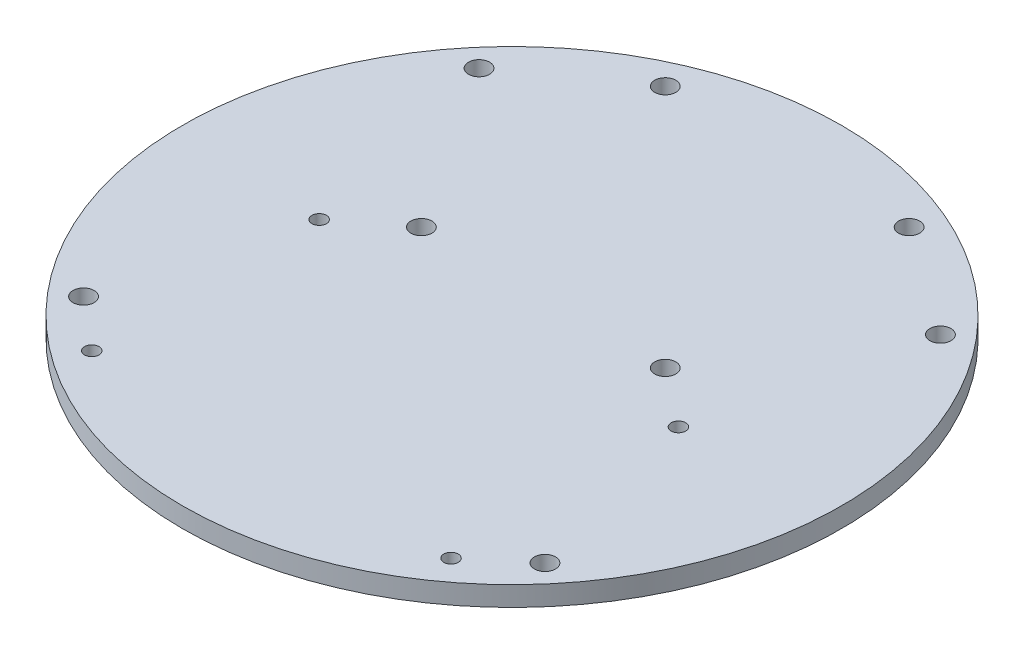
ISO-10303-21;
HEADER;
FILE_DESCRIPTION(('STEP AP214'),'2;1');
FILE_NAME('part.step','',(''),(''),'','','');
FILE_SCHEMA(('AUTOMOTIVE_DESIGN { 1 0 10303 214 1 1 1 1 }'));
ENDSEC;
DATA;
#1=APPLICATION_CONTEXT('core data for automotive mechanical design processes');
#2=APPLICATION_PROTOCOL_DEFINITION('international standard','automotive_design',2000,#1);
#3=PRODUCT_CONTEXT('',#1,'mechanical');
#4=PRODUCT('Part','Part','',(#3));
#5=PRODUCT_RELATED_PRODUCT_CATEGORY('part','',(#4));
#6=PRODUCT_DEFINITION_FORMATION('','',#4);
#7=PRODUCT_DEFINITION_CONTEXT('part definition',#1,'design');
#8=PRODUCT_DEFINITION('design','',#6,#7);
#9=PRODUCT_DEFINITION_SHAPE('','',#8);
#10=(LENGTH_UNIT() NAMED_UNIT(*) SI_UNIT(.MILLI.,.METRE.));
#11=(NAMED_UNIT(*) PLANE_ANGLE_UNIT() SI_UNIT($,.RADIAN.));
#12=(NAMED_UNIT(*) SI_UNIT($,.STERADIAN.) SOLID_ANGLE_UNIT());
#13=UNCERTAINTY_MEASURE_WITH_UNIT(LENGTH_MEASURE(1.E-05),#10,'distance_accuracy_value','');
#14=(GEOMETRIC_REPRESENTATION_CONTEXT(3) GLOBAL_UNCERTAINTY_ASSIGNED_CONTEXT((#13)) GLOBAL_UNIT_ASSIGNED_CONTEXT((#10,
#11,#12)) REPRESENTATION_CONTEXT('',''));
#15=CARTESIAN_POINT('',(0.,0.,0.));
#16=DIRECTION('',(0.,0.,1.));
#17=DIRECTION('',(1.,0.,0.));
#18=AXIS2_PLACEMENT_3D('',#15,#16,#17);
#19=CARTESIAN_POINT('',(0.,3.,0.));
#20=DIRECTION('',(0.,1.,0.));
#21=DIRECTION('',(0.,0.,1.));
#22=AXIS2_PLACEMENT_3D('',#19,#20,#21);
#23=PLANE('',#22);
#24=CARTESIAN_POINT('',(35.,3.,30.));
#25=DIRECTION('',(0.,1.,0.));
#26=DIRECTION('',(0.,0.,-1.));
#27=AXIS2_PLACEMENT_3D('',#24,#25,#26);
#28=CIRCLE('',#27,1.59999999999999);
#29=CARTESIAN_POINT('',(35.,3.,28.4));
#30=VERTEX_POINT('',#29);
#31=EDGE_CURVE('E128',#30,#30,#28,.T.);
#32=ORIENTED_EDGE('',*,*,#31,.F.);
#33=EDGE_LOOP('',(#32));
#34=FACE_BOUND('',#33,.T.);
#35=CARTESIAN_POINT('',(-35.,3.,30.));
#36=DIRECTION('',(0.,1.,0.));
#37=DIRECTION('',(0.,0.,1.));
#38=AXIS2_PLACEMENT_3D('',#35,#36,#37);
#39=CIRCLE('',#38,1.6);
#40=CARTESIAN_POINT('',(-35.,3.,31.6));
#41=VERTEX_POINT('',#40);
#42=EDGE_CURVE('E112',#41,#41,#39,.T.);
#43=ORIENTED_EDGE('',*,*,#42,.F.);
#44=EDGE_LOOP('',(#43));
#45=FACE_BOUND('',#44,.T.);
#46=CARTESIAN_POINT('',(18.5,3.,-4.75));
#47=DIRECTION('',(0.,1.,0.));
#48=DIRECTION('',(0.,0.,1.));
#49=AXIS2_PLACEMENT_3D('',#46,#47,#48);
#50=CIRCLE('',#49,1.6);
#51=CARTESIAN_POINT('',(18.5,3.,-3.15));
#52=VERTEX_POINT('',#51);
#53=EDGE_CURVE('E96',#52,#52,#50,.T.);
#54=ORIENTED_EDGE('',*,*,#53,.F.);
#55=EDGE_LOOP('',(#54));
#56=FACE_BOUND('',#55,.T.);
#57=CARTESIAN_POINT('',(-18.5,3.,-41.75));
#58=DIRECTION('',(0.,1.,0.));
#59=DIRECTION('',(0.,0.,1.));
#60=AXIS2_PLACEMENT_3D('',#57,#58,#59);
#61=CIRCLE('',#60,1.6);
#62=CARTESIAN_POINT('',(-18.5,3.,-40.15));
#63=VERTEX_POINT('',#62);
#64=EDGE_CURVE('E80',#63,#63,#61,.T.);
#65=ORIENTED_EDGE('',*,*,#64,.F.);
#66=EDGE_LOOP('',(#65));
#67=FACE_BOUND('',#66,.T.);
#68=CARTESIAN_POINT('',(27.25,3.,2.));
#69=DIRECTION('',(0.,1.,0.));
#70=DIRECTION('',(0.,0.,-1.));
#71=AXIS2_PLACEMENT_3D('',#68,#69,#70);
#72=CIRCLE('',#71,1.09999999999999);
#73=CARTESIAN_POINT('',(27.25,3.,0.900000000000015));
#74=VERTEX_POINT('',#73);
#75=EDGE_CURVE('E64',#74,#74,#72,.T.);
#76=ORIENTED_EDGE('',*,*,#75,.F.);
#77=EDGE_LOOP('',(#76));
#78=FACE_BOUND('',#77,.T.);
#79=CARTESIAN_POINT('',(-27.25,3.,2.));
#80=DIRECTION('',(0.,1.,0.));
#81=DIRECTION('',(0.,0.,1.));
#82=AXIS2_PLACEMENT_3D('',#79,#80,#81);
#83=CIRCLE('',#82,1.1);
#84=CARTESIAN_POINT('',(-27.25,3.,3.1));
#85=VERTEX_POINT('',#84);
#86=EDGE_CURVE('E50',#85,#85,#83,.T.);
#87=ORIENTED_EDGE('',*,*,#86,.F.);
#88=EDGE_LOOP('',(#87));
#89=FACE_BOUND('',#88,.T.);
#90=CARTESIAN_POINT('',(0.,3.,0.));
#91=DIRECTION('',(0.,1.,0.));
#92=DIRECTION('',(0.,0.,1.));
#93=AXIS2_PLACEMENT_3D('',#90,#91,#92);
#94=CIRCLE('',#93,50.);
#95=CARTESIAN_POINT('',(0.,3.,50.));
#96=VERTEX_POINT('',#95);
#97=EDGE_CURVE('E10',#96,#96,#94,.T.);
#98=ORIENTED_EDGE('',*,*,#97,.T.);
#99=EDGE_LOOP('',(#98));
#100=FACE_BOUND('',#99,.T.);
#101=CARTESIAN_POINT('',(-27.25,3.,36.5));
#102=DIRECTION('',(0.,1.,0.));
#103=DIRECTION('',(0.,0.,-1.));
#104=AXIS2_PLACEMENT_3D('',#101,#102,#103);
#105=CIRCLE('',#104,1.09999999999999);
#106=CARTESIAN_POINT('',(-27.25,3.,35.4));
#107=VERTEX_POINT('',#106);
#108=EDGE_CURVE('E56',#107,#107,#105,.T.);
#109=ORIENTED_EDGE('',*,*,#108,.F.);
#110=EDGE_LOOP('',(#109));
#111=FACE_BOUND('',#110,.T.);
#112=CARTESIAN_POINT('',(27.25,3.,36.5));
#113=DIRECTION('',(0.,1.,0.));
#114=DIRECTION('',(0.,0.,1.));
#115=AXIS2_PLACEMENT_3D('',#112,#113,#114);
#116=CIRCLE('',#115,1.09999999999999);
#117=CARTESIAN_POINT('',(27.25,3.,37.6));
#118=VERTEX_POINT('',#117);
#119=EDGE_CURVE('E72',#118,#118,#116,.T.);
#120=ORIENTED_EDGE('',*,*,#119,.F.);
#121=EDGE_LOOP('',(#120));
#122=FACE_BOUND('',#121,.T.);
#123=CARTESIAN_POINT('',(18.5,3.,-41.75));
#124=DIRECTION('',(0.,1.,0.));
#125=DIRECTION('',(0.,0.,-1.));
#126=AXIS2_PLACEMENT_3D('',#123,#124,#125);
#127=CIRCLE('',#126,1.6);
#128=CARTESIAN_POINT('',(18.5,3.,-43.35));
#129=VERTEX_POINT('',#128);
#130=EDGE_CURVE('E88',#129,#129,#127,.T.);
#131=ORIENTED_EDGE('',*,*,#130,.F.);
#132=EDGE_LOOP('',(#131));
#133=FACE_BOUND('',#132,.T.);
#134=CARTESIAN_POINT('',(-18.5,3.,-4.75));
#135=DIRECTION('',(0.,1.,0.));
#136=DIRECTION('',(0.,0.,-1.));
#137=AXIS2_PLACEMENT_3D('',#134,#135,#136);
#138=CIRCLE('',#137,1.6);
#139=CARTESIAN_POINT('',(-18.5,3.,-6.35));
#140=VERTEX_POINT('',#139);
#141=EDGE_CURVE('E104',#140,#140,#138,.T.);
#142=ORIENTED_EDGE('',*,*,#141,.F.);
#143=EDGE_LOOP('',(#142));
#144=FACE_BOUND('',#143,.T.);
#145=CARTESIAN_POINT('',(-35.,3.,-30.));
#146=DIRECTION('',(0.,1.,0.));
#147=DIRECTION('',(0.,0.,-1.));
#148=AXIS2_PLACEMENT_3D('',#145,#146,#147);
#149=CIRCLE('',#148,1.6);
#150=CARTESIAN_POINT('',(-35.,3.,-31.6));
#151=VERTEX_POINT('',#150);
#152=EDGE_CURVE('E120',#151,#151,#149,.T.);
#153=ORIENTED_EDGE('',*,*,#152,.F.);
#154=EDGE_LOOP('',(#153));
#155=FACE_BOUND('',#154,.T.);
#156=CARTESIAN_POINT('',(35.,3.,-30.));
#157=DIRECTION('',(0.,1.,0.));
#158=DIRECTION('',(0.,0.,1.));
#159=AXIS2_PLACEMENT_3D('',#156,#157,#158);
#160=CIRCLE('',#159,1.59999999999999);
#161=CARTESIAN_POINT('',(35.,3.,-28.4));
#162=VERTEX_POINT('',#161);
#163=EDGE_CURVE('E136',#162,#162,#160,.T.);
#164=ORIENTED_EDGE('',*,*,#163,.F.);
#165=EDGE_LOOP('',(#164));
#166=FACE_BOUND('',#165,.T.);
#167=ADVANCED_FACE('F37',(#34,#45,#56,#67,#78,#89,#100,#111,#122,#133,#144,#155,#166),#23,.T.);
#168=CARTESIAN_POINT('',(0.,0.,0.));
#169=DIRECTION('',(0.,1.,0.));
#170=DIRECTION('',(0.,0.,1.));
#171=AXIS2_PLACEMENT_3D('',#168,#169,#170);
#172=PLANE('',#171);
#173=CARTESIAN_POINT('',(0.,0.,0.));
#174=DIRECTION('',(0.,1.,0.));
#175=DIRECTION('',(0.,0.,1.));
#176=AXIS2_PLACEMENT_3D('',#173,#174,#175);
#177=CIRCLE('',#176,50.);
#178=CARTESIAN_POINT('',(0.,0.,50.));
#179=VERTEX_POINT('',#178);
#180=EDGE_CURVE('E41',#179,#179,#177,.T.);
#181=ORIENTED_EDGE('',*,*,#180,.F.);
#182=EDGE_LOOP('',(#181));
#183=FACE_BOUND('',#182,.T.);
#184=CARTESIAN_POINT('',(-27.25,0.,2.));
#185=DIRECTION('',(0.,1.,0.));
#186=DIRECTION('',(0.,0.,1.));
#187=AXIS2_PLACEMENT_3D('',#184,#185,#186);
#188=CIRCLE('',#187,1.1);
#189=CARTESIAN_POINT('',(-27.25,0.,3.1));
#190=VERTEX_POINT('',#189);
#191=EDGE_CURVE('E52',#190,#190,#188,.T.);
#192=ORIENTED_EDGE('',*,*,#191,.T.);
#193=EDGE_LOOP('',(#192));
#194=FACE_BOUND('',#193,.T.);
#195=CARTESIAN_POINT('',(-27.25,0.,36.5));
#196=DIRECTION('',(0.,1.,0.));
#197=DIRECTION('',(0.,0.,-1.));
#198=AXIS2_PLACEMENT_3D('',#195,#196,#197);
#199=CIRCLE('',#198,1.09999999999999);
#200=CARTESIAN_POINT('',(-27.25,0.,35.4));
#201=VERTEX_POINT('',#200);
#202=EDGE_CURVE('E60',#201,#201,#199,.T.);
#203=ORIENTED_EDGE('',*,*,#202,.T.);
#204=EDGE_LOOP('',(#203));
#205=FACE_BOUND('',#204,.T.);
#206=CARTESIAN_POINT('',(27.25,0.,2.));
#207=DIRECTION('',(0.,1.,0.));
#208=DIRECTION('',(0.,0.,-1.));
#209=AXIS2_PLACEMENT_3D('',#206,#207,#208);
#210=CIRCLE('',#209,1.09999999999999);
#211=CARTESIAN_POINT('',(27.25,0.,0.900000000000015));
#212=VERTEX_POINT('',#211);
#213=EDGE_CURVE('E68',#212,#212,#210,.T.);
#214=ORIENTED_EDGE('',*,*,#213,.T.);
#215=EDGE_LOOP('',(#214));
#216=FACE_BOUND('',#215,.T.);
#217=CARTESIAN_POINT('',(27.25,0.,36.5));
#218=DIRECTION('',(0.,1.,0.));
#219=DIRECTION('',(0.,0.,1.));
#220=AXIS2_PLACEMENT_3D('',#217,#218,#219);
#221=CIRCLE('',#220,1.09999999999999);
#222=CARTESIAN_POINT('',(27.25,0.,37.6));
#223=VERTEX_POINT('',#222);
#224=EDGE_CURVE('E76',#223,#223,#221,.T.);
#225=ORIENTED_EDGE('',*,*,#224,.T.);
#226=EDGE_LOOP('',(#225));
#227=FACE_BOUND('',#226,.T.);
#228=CARTESIAN_POINT('',(-18.5,0.,-41.75));
#229=DIRECTION('',(0.,1.,0.));
#230=DIRECTION('',(0.,0.,1.));
#231=AXIS2_PLACEMENT_3D('',#228,#229,#230);
#232=CIRCLE('',#231,1.6);
#233=CARTESIAN_POINT('',(-18.5,0.,-40.15));
#234=VERTEX_POINT('',#233);
#235=EDGE_CURVE('E84',#234,#234,#232,.T.);
#236=ORIENTED_EDGE('',*,*,#235,.T.);
#237=EDGE_LOOP('',(#236));
#238=FACE_BOUND('',#237,.T.);
#239=CARTESIAN_POINT('',(18.5,0.,-41.75));
#240=DIRECTION('',(0.,1.,0.));
#241=DIRECTION('',(0.,0.,-1.));
#242=AXIS2_PLACEMENT_3D('',#239,#240,#241);
#243=CIRCLE('',#242,1.6);
#244=CARTESIAN_POINT('',(18.5,0.,-43.35));
#245=VERTEX_POINT('',#244);
#246=EDGE_CURVE('E92',#245,#245,#243,.T.);
#247=ORIENTED_EDGE('',*,*,#246,.T.);
#248=EDGE_LOOP('',(#247));
#249=FACE_BOUND('',#248,.T.);
#250=CARTESIAN_POINT('',(18.5,0.,-4.75));
#251=DIRECTION('',(0.,1.,0.));
#252=DIRECTION('',(0.,0.,1.));
#253=AXIS2_PLACEMENT_3D('',#250,#251,#252);
#254=CIRCLE('',#253,1.6);
#255=CARTESIAN_POINT('',(18.5,0.,-3.15));
#256=VERTEX_POINT('',#255);
#257=EDGE_CURVE('E100',#256,#256,#254,.T.);
#258=ORIENTED_EDGE('',*,*,#257,.T.);
#259=EDGE_LOOP('',(#258));
#260=FACE_BOUND('',#259,.T.);
#261=CARTESIAN_POINT('',(-18.5,0.,-4.75));
#262=DIRECTION('',(0.,1.,0.));
#263=DIRECTION('',(0.,0.,-1.));
#264=AXIS2_PLACEMENT_3D('',#261,#262,#263);
#265=CIRCLE('',#264,1.6);
#266=CARTESIAN_POINT('',(-18.5,0.,-6.35));
#267=VERTEX_POINT('',#266);
#268=EDGE_CURVE('E108',#267,#267,#265,.T.);
#269=ORIENTED_EDGE('',*,*,#268,.T.);
#270=EDGE_LOOP('',(#269));
#271=FACE_BOUND('',#270,.T.);
#272=CARTESIAN_POINT('',(-35.,0.,30.));
#273=DIRECTION('',(0.,1.,0.));
#274=DIRECTION('',(0.,0.,1.));
#275=AXIS2_PLACEMENT_3D('',#272,#273,#274);
#276=CIRCLE('',#275,1.6);
#277=CARTESIAN_POINT('',(-35.,0.,31.6));
#278=VERTEX_POINT('',#277);
#279=EDGE_CURVE('E116',#278,#278,#276,.T.);
#280=ORIENTED_EDGE('',*,*,#279,.T.);
#281=EDGE_LOOP('',(#280));
#282=FACE_BOUND('',#281,.T.);
#283=CARTESIAN_POINT('',(-35.,0.,-30.));
#284=DIRECTION('',(0.,1.,0.));
#285=DIRECTION('',(0.,0.,-1.));
#286=AXIS2_PLACEMENT_3D('',#283,#284,#285);
#287=CIRCLE('',#286,1.6);
#288=CARTESIAN_POINT('',(-35.,0.,-31.6));
#289=VERTEX_POINT('',#288);
#290=EDGE_CURVE('E124',#289,#289,#287,.T.);
#291=ORIENTED_EDGE('',*,*,#290,.T.);
#292=EDGE_LOOP('',(#291));
#293=FACE_BOUND('',#292,.T.);
#294=CARTESIAN_POINT('',(35.,0.,30.));
#295=DIRECTION('',(0.,1.,0.));
#296=DIRECTION('',(0.,0.,-1.));
#297=AXIS2_PLACEMENT_3D('',#294,#295,#296);
#298=CIRCLE('',#297,1.59999999999999);
#299=CARTESIAN_POINT('',(35.,0.,28.4));
#300=VERTEX_POINT('',#299);
#301=EDGE_CURVE('E132',#300,#300,#298,.T.);
#302=ORIENTED_EDGE('',*,*,#301,.T.);
#303=EDGE_LOOP('',(#302));
#304=FACE_BOUND('',#303,.T.);
#305=CARTESIAN_POINT('',(35.,0.,-30.));
#306=DIRECTION('',(0.,1.,0.));
#307=DIRECTION('',(0.,0.,1.));
#308=AXIS2_PLACEMENT_3D('',#305,#306,#307);
#309=CIRCLE('',#308,1.59999999999999);
#310=CARTESIAN_POINT('',(35.,0.,-28.4));
#311=VERTEX_POINT('',#310);
#312=EDGE_CURVE('E140',#311,#311,#309,.T.);
#313=ORIENTED_EDGE('',*,*,#312,.T.);
#314=EDGE_LOOP('',(#313));
#315=FACE_BOUND('',#314,.T.);
#316=ADVANCED_FACE('F152',(#183,#194,#205,#216,#227,#238,#249,#260,#271,#282,#293,#304,#315),
#172,.F.);
#317=CARTESIAN_POINT('',(0.,3.,0.));
#318=DIRECTION('',(0.,-1.,0.));
#319=DIRECTION('',(0.,0.,-1.));
#320=AXIS2_PLACEMENT_3D('',#317,#318,#319);
#321=CYLINDRICAL_SURFACE('',#320,50.);
#322=ORIENTED_EDGE('',*,*,#97,.F.);
#323=EDGE_LOOP('',(#322));
#324=FACE_BOUND('',#323,.T.);
#325=ORIENTED_EDGE('',*,*,#180,.T.);
#326=EDGE_LOOP('',(#325));
#327=FACE_BOUND('',#326,.T.);
#328=ADVANCED_FACE('F39',(#324,#327),#321,.T.);
#329=CARTESIAN_POINT('',(-27.25,3.,2.));
#330=DIRECTION('',(0.,-1.,0.));
#331=DIRECTION('',(0.,0.,-1.));
#332=AXIS2_PLACEMENT_3D('',#329,#330,#331);
#333=CYLINDRICAL_SURFACE('',#332,1.1);
#334=ORIENTED_EDGE('',*,*,#86,.T.);
#335=EDGE_LOOP('',(#334));
#336=FACE_BOUND('',#335,.T.);
#337=ORIENTED_EDGE('',*,*,#191,.F.);
#338=EDGE_LOOP('',(#337));
#339=FACE_BOUND('',#338,.T.);
#340=ADVANCED_FACE('F162',(#336,#339),#333,.F.);
#341=CARTESIAN_POINT('',(-27.25,3.,36.5));
#342=DIRECTION('',(0.,-1.,0.));
#343=DIRECTION('',(0.,0.,-1.));
#344=AXIS2_PLACEMENT_3D('',#341,#342,#343);
#345=CYLINDRICAL_SURFACE('',#344,1.09999999999999);
#346=ORIENTED_EDGE('',*,*,#108,.T.);
#347=EDGE_LOOP('',(#346));
#348=FACE_BOUND('',#347,.T.);
#349=ORIENTED_EDGE('',*,*,#202,.F.);
#350=EDGE_LOOP('',(#349));
#351=FACE_BOUND('',#350,.T.);
#352=ADVANCED_FACE('F165',(#348,#351),#345,.F.);
#353=CARTESIAN_POINT('',(27.25,3.,2.));
#354=DIRECTION('',(0.,-1.,0.));
#355=DIRECTION('',(0.,0.,-1.));
#356=AXIS2_PLACEMENT_3D('',#353,#354,#355);
#357=CYLINDRICAL_SURFACE('',#356,1.09999999999999);
#358=ORIENTED_EDGE('',*,*,#75,.T.);
#359=EDGE_LOOP('',(#358));
#360=FACE_BOUND('',#359,.T.);
#361=ORIENTED_EDGE('',*,*,#213,.F.);
#362=EDGE_LOOP('',(#361));
#363=FACE_BOUND('',#362,.T.);
#364=ADVANCED_FACE('F169',(#360,#363),#357,.F.);
#365=CARTESIAN_POINT('',(27.25,3.,36.5));
#366=DIRECTION('',(0.,-1.,0.));
#367=DIRECTION('',(0.,0.,-1.));
#368=AXIS2_PLACEMENT_3D('',#365,#366,#367);
#369=CYLINDRICAL_SURFACE('',#368,1.09999999999999);
#370=ORIENTED_EDGE('',*,*,#119,.T.);
#371=EDGE_LOOP('',(#370));
#372=FACE_BOUND('',#371,.T.);
#373=ORIENTED_EDGE('',*,*,#224,.F.);
#374=EDGE_LOOP('',(#373));
#375=FACE_BOUND('',#374,.T.);
#376=ADVANCED_FACE('F173',(#372,#375),#369,.F.);
#377=CARTESIAN_POINT('',(-18.5,3.,-41.75));
#378=DIRECTION('',(0.,-1.,0.));
#379=DIRECTION('',(0.,0.,-1.));
#380=AXIS2_PLACEMENT_3D('',#377,#378,#379);
#381=CYLINDRICAL_SURFACE('',#380,1.6);
#382=ORIENTED_EDGE('',*,*,#64,.T.);
#383=EDGE_LOOP('',(#382));
#384=FACE_BOUND('',#383,.T.);
#385=ORIENTED_EDGE('',*,*,#235,.F.);
#386=EDGE_LOOP('',(#385));
#387=FACE_BOUND('',#386,.T.);
#388=ADVANCED_FACE('F177',(#384,#387),#381,.F.);
#389=CARTESIAN_POINT('',(18.5,3.,-41.75));
#390=DIRECTION('',(0.,-1.,0.));
#391=DIRECTION('',(0.,0.,-1.));
#392=AXIS2_PLACEMENT_3D('',#389,#390,#391);
#393=CYLINDRICAL_SURFACE('',#392,1.6);
#394=ORIENTED_EDGE('',*,*,#130,.T.);
#395=EDGE_LOOP('',(#394));
#396=FACE_BOUND('',#395,.T.);
#397=ORIENTED_EDGE('',*,*,#246,.F.);
#398=EDGE_LOOP('',(#397));
#399=FACE_BOUND('',#398,.T.);
#400=ADVANCED_FACE('F181',(#396,#399),#393,.F.);
#401=CARTESIAN_POINT('',(18.5,3.,-4.75));
#402=DIRECTION('',(0.,-1.,0.));
#403=DIRECTION('',(0.,0.,-1.));
#404=AXIS2_PLACEMENT_3D('',#401,#402,#403);
#405=CYLINDRICAL_SURFACE('',#404,1.6);
#406=ORIENTED_EDGE('',*,*,#53,.T.);
#407=EDGE_LOOP('',(#406));
#408=FACE_BOUND('',#407,.T.);
#409=ORIENTED_EDGE('',*,*,#257,.F.);
#410=EDGE_LOOP('',(#409));
#411=FACE_BOUND('',#410,.T.);
#412=ADVANCED_FACE('F185',(#408,#411),#405,.F.);
#413=CARTESIAN_POINT('',(-18.5,3.,-4.75));
#414=DIRECTION('',(0.,-1.,0.));
#415=DIRECTION('',(0.,0.,-1.));
#416=AXIS2_PLACEMENT_3D('',#413,#414,#415);
#417=CYLINDRICAL_SURFACE('',#416,1.6);
#418=ORIENTED_EDGE('',*,*,#141,.T.);
#419=EDGE_LOOP('',(#418));
#420=FACE_BOUND('',#419,.T.);
#421=ORIENTED_EDGE('',*,*,#268,.F.);
#422=EDGE_LOOP('',(#421));
#423=FACE_BOUND('',#422,.T.);
#424=ADVANCED_FACE('F189',(#420,#423),#417,.F.);
#425=CARTESIAN_POINT('',(-35.,3.,30.));
#426=DIRECTION('',(0.,-1.,0.));
#427=DIRECTION('',(0.,0.,-1.));
#428=AXIS2_PLACEMENT_3D('',#425,#426,#427);
#429=CYLINDRICAL_SURFACE('',#428,1.6);
#430=ORIENTED_EDGE('',*,*,#42,.T.);
#431=EDGE_LOOP('',(#430));
#432=FACE_BOUND('',#431,.T.);
#433=ORIENTED_EDGE('',*,*,#279,.F.);
#434=EDGE_LOOP('',(#433));
#435=FACE_BOUND('',#434,.T.);
#436=ADVANCED_FACE('F193',(#432,#435),#429,.F.);
#437=CARTESIAN_POINT('',(-35.,3.,-30.));
#438=DIRECTION('',(0.,-1.,0.));
#439=DIRECTION('',(0.,0.,-1.));
#440=AXIS2_PLACEMENT_3D('',#437,#438,#439);
#441=CYLINDRICAL_SURFACE('',#440,1.6);
#442=ORIENTED_EDGE('',*,*,#152,.T.);
#443=EDGE_LOOP('',(#442));
#444=FACE_BOUND('',#443,.T.);
#445=ORIENTED_EDGE('',*,*,#290,.F.);
#446=EDGE_LOOP('',(#445));
#447=FACE_BOUND('',#446,.T.);
#448=ADVANCED_FACE('F197',(#444,#447),#441,.F.);
#449=CARTESIAN_POINT('',(35.,3.,30.));
#450=DIRECTION('',(0.,-1.,0.));
#451=DIRECTION('',(0.,0.,-1.));
#452=AXIS2_PLACEMENT_3D('',#449,#450,#451);
#453=CYLINDRICAL_SURFACE('',#452,1.59999999999999);
#454=ORIENTED_EDGE('',*,*,#31,.T.);
#455=EDGE_LOOP('',(#454));
#456=FACE_BOUND('',#455,.T.);
#457=ORIENTED_EDGE('',*,*,#301,.F.);
#458=EDGE_LOOP('',(#457));
#459=FACE_BOUND('',#458,.T.);
#460=ADVANCED_FACE('F201',(#456,#459),#453,.F.);
#461=CARTESIAN_POINT('',(35.,3.,-30.));
#462=DIRECTION('',(0.,-1.,0.));
#463=DIRECTION('',(0.,0.,-1.));
#464=AXIS2_PLACEMENT_3D('',#461,#462,#463);
#465=CYLINDRICAL_SURFACE('',#464,1.59999999999999);
#466=ORIENTED_EDGE('',*,*,#163,.T.);
#467=EDGE_LOOP('',(#466));
#468=FACE_BOUND('',#467,.T.);
#469=ORIENTED_EDGE('',*,*,#312,.F.);
#470=EDGE_LOOP('',(#469));
#471=FACE_BOUND('',#470,.T.);
#472=ADVANCED_FACE('F148',(#468,#471),#465,.F.);
#473=CLOSED_SHELL('',(#167,#316,#328,#340,#352,#364,#376,#388,#400,#412,#424,#436,#448,#460,#472));
#474=MANIFOLD_SOLID_BREP('B2',#473);
#475=ADVANCED_BREP_SHAPE_REPRESENTATION('',(#18,#474),#14);
#476=SHAPE_DEFINITION_REPRESENTATION(#9,#475);
ENDSEC;
END-ISO-10303-21;
